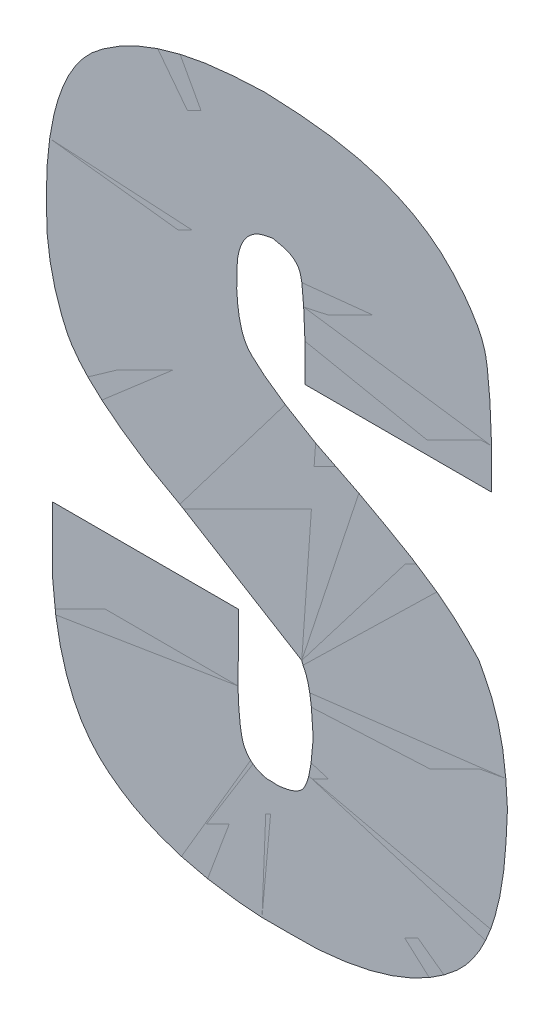
ISO-10303-21;
HEADER;
FILE_DESCRIPTION(('STEP AP214'),'2;1');
FILE_NAME('part.step','',(''),(''),'','','');
FILE_SCHEMA(('AUTOMOTIVE_DESIGN { 1 0 10303 214 1 1 1 1 }'));
ENDSEC;
DATA;
#1=APPLICATION_CONTEXT('core data for automotive mechanical design processes');
#2=APPLICATION_PROTOCOL_DEFINITION('international standard','automotive_design',2000,#1);
#3=PRODUCT_CONTEXT('',#1,'mechanical');
#4=PRODUCT('Part','Part','',(#3));
#5=PRODUCT_RELATED_PRODUCT_CATEGORY('part','',(#4));
#6=PRODUCT_DEFINITION_FORMATION('','',#4);
#7=PRODUCT_DEFINITION_CONTEXT('part definition',#1,'design');
#8=PRODUCT_DEFINITION('design','',#6,#7);
#9=PRODUCT_DEFINITION_SHAPE('','',#8);
#10=(LENGTH_UNIT() NAMED_UNIT(*) SI_UNIT(.MILLI.,.METRE.));
#11=(NAMED_UNIT(*) PLANE_ANGLE_UNIT() SI_UNIT($,.RADIAN.));
#12=(NAMED_UNIT(*) SI_UNIT($,.STERADIAN.) SOLID_ANGLE_UNIT());
#13=UNCERTAINTY_MEASURE_WITH_UNIT(LENGTH_MEASURE(1.E-05),#10,'distance_accuracy_value','');
#14=(GEOMETRIC_REPRESENTATION_CONTEXT(3) GLOBAL_UNCERTAINTY_ASSIGNED_CONTEXT((#13)) GLOBAL_UNIT_ASSIGNED_CONTEXT((#10,
#11,#12)) REPRESENTATION_CONTEXT('',''));
#15=CARTESIAN_POINT('',(0.,0.,0.));
#16=DIRECTION('',(0.,0.,1.));
#17=DIRECTION('',(1.,0.,0.));
#18=AXIS2_PLACEMENT_3D('',#15,#16,#17);
#19=CARTESIAN_POINT('',(6.842343384447,0.781799056295,0.001668));
#20=DIRECTION('',(0.,0.,1.));
#21=DIRECTION('',(1.,0.,0.));
#22=AXIS2_PLACEMENT_3D('',#19,#20,#21);
#23=PLANE('',#22);
#24=CARTESIAN_POINT('',(6.841944020248,0.844309953316,0.001668));
#25=CARTESIAN_POINT('',(6.84735743524991,0.844054387373995,0.001668));
#26=CARTESIAN_POINT('',(6.8491180972205,0.840933917094,0.001668));
#27=CARTESIAN_POINT('',(6.850552912615,0.838390953782129,0.001668));
#28=CARTESIAN_POINT('',(6.850552912615,0.824897745039,0.001668));
#29=B_SPLINE_CURVE_WITH_KNOTS('',2,(#24,#25,#26,#27,#28),.UNSPECIFIED.,.F.,.F.,(3,2,3),(0.,0.5,
1.),.UNSPECIFIED.);
#30=CARTESIAN_POINT('',(6.841944020248,0.844309953316,0.0015));
#31=VERTEX_POINT('',#30);
#32=CARTESIAN_POINT('',(6.850552912615,0.824897745039,0.0015));
#33=VERTEX_POINT('',#32);
#34=EDGE_CURVE('E363',#31,#33,#29,.T.);
#35=ORIENTED_EDGE('',*,*,#34,.T.);
#36=CARTESIAN_POINT('',(6.850552912615,0.824897745039,0.001668));
#37=DIRECTION('',(0.,-1.,0.));
#38=VECTOR('',#37,1.);
#39=LINE('',#36,#38);
#40=CARTESIAN_POINT('',(6.850552912615,0.814938438183,0.0015));
#41=VERTEX_POINT('',#40);
#42=EDGE_CURVE('E28',#33,#41,#39,.T.);
#43=ORIENTED_EDGE('',*,*,#42,.T.);
#44=CARTESIAN_POINT('',(6.850552912615,0.814938438183,0.001668));
#45=DIRECTION('',(1.,0.,0.));
#46=VECTOR('',#45,1.);
#47=LINE('',#44,#46);
#48=CARTESIAN_POINT('',(6.90018064508,0.814938438183,0.0015));
#49=VERTEX_POINT('',#48);
#50=EDGE_CURVE('E11',#41,#49,#47,.T.);
#51=ORIENTED_EDGE('',*,*,#50,.T.);
#52=CARTESIAN_POINT('',(6.90018064508,0.814938438183,0.001668));
#53=DIRECTION('',(0.,1.,0.));
#54=VECTOR('',#53,1.);
#55=LINE('',#52,#54);
#56=CARTESIAN_POINT('',(6.90018064508,0.825572952283,0.0015));
#57=VERTEX_POINT('',#56);
#58=EDGE_CURVE('E92',#49,#57,#55,.T.);
#59=ORIENTED_EDGE('',*,*,#58,.T.);
#60=CARTESIAN_POINT('',(6.90018064508,0.825572952283,0.001668));
#61=CARTESIAN_POINT('',(6.90018064508,0.838816903601868,0.001668));
#62=CARTESIAN_POINT('',(6.8987458296855,0.8459135705215,0.001668));
#63=CARTESIAN_POINT('',(6.89750927055009,0.85202965231435,0.001668));
#64=CARTESIAN_POINT('',(6.890474540941,0.860008521749,0.001668));
#65=CARTESIAN_POINT('',(6.87559179209619,0.876888702859,0.001668));
#66=CARTESIAN_POINT('',(6.839749596704,0.876888702859,0.001668));
#67=B_SPLINE_CURVE_WITH_KNOTS('',2,(#60,#61,#62,#63,#64,#65,#66),.UNSPECIFIED.,.F.,.F.,(3,2,2,
3),(0.,0.25,0.5,1.),.UNSPECIFIED.);
#68=CARTESIAN_POINT('',(6.839749596704,0.876888702859,0.0015));
#69=VERTEX_POINT('',#68);
#70=EDGE_CURVE('E89',#57,#69,#67,.T.);
#71=ORIENTED_EDGE('',*,*,#70,.T.);
#72=CARTESIAN_POINT('',(6.839749596704,0.876888702859,0.001668));
#73=CARTESIAN_POINT('',(6.8113718671602,0.876888702859,0.001668));
#74=CARTESIAN_POINT('',(6.79552352219413,0.864376268610875,0.001668));
#75=CARTESIAN_POINT('',(6.781850575494,0.853581334065366,0.001668));
#76=CARTESIAN_POINT('',(6.781850575494,0.822534519683,0.001668));
#77=B_SPLINE_CURVE_WITH_KNOTS('',2,(#72,#73,#74,#75,#76),.UNSPECIFIED.,.F.,.F.,(3,2,3),(0.,0.5,
1.),.UNSPECIFIED.);
#78=CARTESIAN_POINT('',(6.781850575494,0.822534519683,0.0015));
#79=VERTEX_POINT('',#78);
#80=EDGE_CURVE('E239',#69,#79,#77,.T.);
#81=ORIENTED_EDGE('',*,*,#80,.T.);
#82=CARTESIAN_POINT('',(6.781850575494,0.822534519683,0.001668));
#83=CARTESIAN_POINT('',(6.781850575494,0.807498247992182,0.001668));
#84=CARTESIAN_POINT('',(6.7872522334495,0.7958638335285,0.001668));
#85=CARTESIAN_POINT('',(6.79244996611719,0.784668645564816,0.001668));
#86=CARTESIAN_POINT('',(6.817298955827,0.770712363674,0.001668));
#87=B_SPLINE_CURVE_WITH_KNOTS('',2,(#82,#83,#84,#85,#86),.UNSPECIFIED.,.F.,.F.,(3,2,3),(0.,0.5,
1.),.UNSPECIFIED.);
#88=CARTESIAN_POINT('',(6.817298955827,0.770712363674,0.0015));
#89=VERTEX_POINT('',#88);
#90=EDGE_CURVE('E236',#79,#89,#87,.T.);
#91=ORIENTED_EDGE('',*,*,#90,.T.);
#92=CARTESIAN_POINT('',(6.817298955827,0.770712363674,0.001668));
#93=DIRECTION('',(0.853940796175856,-0.520370172691081,0.));
#94=VECTOR('',#93,1.);
#95=LINE('',#92,#94);
#96=CARTESIAN_POINT('',(6.849708903559,0.750962551774,0.0015));
#97=VERTEX_POINT('',#96);
#98=EDGE_CURVE('E224',#89,#97,#95,.T.);
#99=ORIENTED_EDGE('',*,*,#98,.T.);
#100=CARTESIAN_POINT('',(6.849708903559,0.750962551774,0.001668));
#101=CARTESIAN_POINT('',(6.852747336159,0.746872302777746,0.001668));
#102=CARTESIAN_POINT('',(6.852747336159,0.734588776097,0.001668));
#103=B_SPLINE_CURVE_WITH_KNOTS('',2,(#100,#101,#102),.UNSPECIFIED.,.F.,.F.,(3,3),(0.,1.),.UNSPECIFIED.);
#104=CARTESIAN_POINT('',(6.852747336159,0.734588776097,0.0015));
#105=VERTEX_POINT('',#104);
#106=EDGE_CURVE('E233',#97,#105,#103,.T.);
#107=ORIENTED_EDGE('',*,*,#106,.T.);
#108=CARTESIAN_POINT('',(6.852747336159,0.734588776097,0.001668));
#109=CARTESIAN_POINT('',(6.85256843999959,0.725471815599463,0.001668));
#110=CARTESIAN_POINT('',(6.8503841108035,0.7220130411695,0.001668));
#111=CARTESIAN_POINT('',(6.84868306782237,0.719319525934746,0.001668));
#112=CARTESIAN_POINT('',(6.842112822059,0.719059009475,0.001668));
#113=B_SPLINE_CURVE_WITH_KNOTS('',2,(#108,#109,#110,#111,#112),.UNSPECIFIED.,.F.,.F.,(3,2,3),
(0.,0.5,1.),.UNSPECIFIED.);
#114=CARTESIAN_POINT('',(6.842112822059,0.719059009475,0.0015));
#115=VERTEX_POINT('',#114);
#116=EDGE_CURVE('E238',#105,#115,#113,.T.);
#117=ORIENTED_EDGE('',*,*,#116,.T.);
#118=CARTESIAN_POINT('',(6.842112822059,0.719059009475,0.001668));
#119=CARTESIAN_POINT('',(6.83682348482915,0.719391245199637,0.001668));
#120=CARTESIAN_POINT('',(6.8346855423705,0.723447856564,0.001668));
#121=CARTESIAN_POINT('',(6.832828722448,0.726971055595247,0.001668));
#122=CARTESIAN_POINT('',(6.832828722448,0.74269126303,0.001668));
#123=B_SPLINE_CURVE_WITH_KNOTS('',2,(#118,#119,#120,#121,#122),.UNSPECIFIED.,.F.,.F.,(3,2,3),
(0.,0.5,1.),.UNSPECIFIED.);
#124=CARTESIAN_POINT('',(6.832828722448,0.74269126303,0.0015));
#125=VERTEX_POINT('',#124);
#126=EDGE_CURVE('E286',#115,#125,#123,.T.);
#127=ORIENTED_EDGE('',*,*,#126,.T.);
#128=CARTESIAN_POINT('',(6.832828722448,0.74269126303,0.001668));
#129=DIRECTION('',(0.,1.,0.));
#130=VECTOR('',#129,1.);
#131=LINE('',#128,#130);
#132=CARTESIAN_POINT('',(6.832828722448,0.754338587996,0.0015));
#133=VERTEX_POINT('',#132);
#134=EDGE_CURVE('E374',#125,#133,#131,.T.);
#135=ORIENTED_EDGE('',*,*,#134,.T.);
#136=CARTESIAN_POINT('',(6.832828722448,0.754338587996,0.001668));
#137=DIRECTION('',(-1.,0.,0.));
#138=VECTOR('',#137,1.);
#139=LINE('',#136,#138);
#140=CARTESIAN_POINT('',(6.783369791794,0.754338587996,0.0015));
#141=VERTEX_POINT('',#140);
#142=EDGE_CURVE('E372',#133,#141,#139,.T.);
#143=ORIENTED_EDGE('',*,*,#142,.T.);
#144=CARTESIAN_POINT('',(6.783369791794,0.754338587996,0.001668));
#145=DIRECTION('',(0.,-1.,0.));
#146=VECTOR('',#145,1.);
#147=LINE('',#144,#146);
#148=CARTESIAN_POINT('',(6.783369791794,0.745560893819,0.0015));
#149=VERTEX_POINT('',#148);
#150=EDGE_CURVE('E371',#141,#149,#147,.T.);
#151=ORIENTED_EDGE('',*,*,#150,.T.);
#152=CARTESIAN_POINT('',(6.783369791794,0.745560893819,0.001668));
#153=CARTESIAN_POINT('',(6.783369791794,0.713191998116072,0.001668));
#154=CARTESIAN_POINT('',(6.79706383872,0.700976115460375,0.001668));
#155=CARTESIAN_POINT('',(6.81331374316268,0.686480259932,0.001668));
#156=CARTESIAN_POINT('',(6.846332867337,0.686480259932,0.001668));
#157=B_SPLINE_CURVE_WITH_KNOTS('',2,(#152,#153,#154,#155,#156),.UNSPECIFIED.,.F.,.F.,(3,2,3),
(0.,0.5,1.),.UNSPECIFIED.);
#158=CARTESIAN_POINT('',(6.846332867337,0.686480259932,0.0015));
#159=VERTEX_POINT('',#158);
#160=EDGE_CURVE('E299',#149,#159,#157,.T.);
#161=ORIENTED_EDGE('',*,*,#160,.T.);
#162=CARTESIAN_POINT('',(6.846332867337,0.686480259932,0.001668));
#163=CARTESIAN_POINT('',(6.87523705434836,0.686480259932,0.001668));
#164=CARTESIAN_POINT('',(6.89081214456325,0.70011100617825,0.001668));
#165=CARTESIAN_POINT('',(6.904400690357,0.712003201794113,0.001668));
#166=CARTESIAN_POINT('',(6.904400690357,0.744041677519,0.001668));
#167=B_SPLINE_CURVE_WITH_KNOTS('',2,(#162,#163,#164,#165,#166),.UNSPECIFIED.,.F.,.F.,(3,2,3),
(0.,0.5,1.),.UNSPECIFIED.);
#168=CARTESIAN_POINT('',(6.904400690357,0.744041677519,0.0015));
#169=VERTEX_POINT('',#168);
#170=EDGE_CURVE('E310',#159,#169,#167,.T.);
#171=ORIENTED_EDGE('',*,*,#170,.T.);
#172=CARTESIAN_POINT('',(6.904400690357,0.744041677519,0.001668));
#173=CARTESIAN_POINT('',(6.904400690357,0.763338874595314,0.001668));
#174=CARTESIAN_POINT('',(6.896804608858,0.774594805329,0.001668));
#175=B_SPLINE_CURVE_WITH_KNOTS('',2,(#172,#173,#174),.UNSPECIFIED.,.F.,.F.,(3,3),(0.,1.),.UNSPECIFIED.);
#176=CARTESIAN_POINT('',(6.896804608858,0.774594805329,0.0015));
#177=VERTEX_POINT('',#176);
#178=EDGE_CURVE('E321',#169,#177,#175,.T.);
#179=ORIENTED_EDGE('',*,*,#178,.T.);
#180=CARTESIAN_POINT('',(6.896804608858,0.774594805329,0.001668));
#181=CARTESIAN_POINT('',(6.88825229663385,0.785694153808786,0.001668));
#182=CARTESIAN_POINT('',(6.864901066559,0.797045446206,0.001668));
#183=B_SPLINE_CURVE_WITH_KNOTS('',2,(#180,#181,#182),.UNSPECIFIED.,.F.,.F.,(3,3),(0.,1.),.UNSPECIFIED.);
#184=CARTESIAN_POINT('',(6.864901066559,0.797045446206,0.0015));
#185=VERTEX_POINT('',#184);
#186=EDGE_CURVE('E332',#177,#185,#183,.T.);
#187=ORIENTED_EDGE('',*,*,#186,.T.);
#188=CARTESIAN_POINT('',(6.864901066559,0.797045446206,0.001668));
#189=CARTESIAN_POINT('',(6.84265966103299,0.808166148969004,0.001668));
#190=CARTESIAN_POINT('',(6.83603595685963,0.815276041805875,0.001668));
#191=CARTESIAN_POINT('',(6.832491118826,0.819081075648492,0.001668));
#192=CARTESIAN_POINT('',(6.832491118826,0.831818619294,0.001668));
#193=B_SPLINE_CURVE_WITH_KNOTS('',2,(#188,#189,#190,#191,#192),.UNSPECIFIED.,.F.,.F.,(3,2,3),
(0.,0.5,1.),.UNSPECIFIED.);
#194=CARTESIAN_POINT('',(6.832491118826,0.831818619294,0.0015));
#195=VERTEX_POINT('',#194);
#196=EDGE_CURVE('E343',#185,#195,#193,.T.);
#197=ORIENTED_EDGE('',*,*,#196,.T.);
#198=CARTESIAN_POINT('',(6.832491118826,0.831818619294,0.001668));
#199=CARTESIAN_POINT('',(6.83284891114482,0.843837156323268,0.001668));
#200=CARTESIAN_POINT('',(6.841944020248,0.844309953316,0.001668));
#201=B_SPLINE_CURVE_WITH_KNOTS('',2,(#198,#199,#200),.UNSPECIFIED.,.F.,.F.,(3,3),(0.,1.),.UNSPECIFIED.);
#202=EDGE_CURVE('E353',#195,#31,#201,.T.);
#203=ORIENTED_EDGE('',*,*,#202,.T.);
#204=EDGE_LOOP('',(#35,#43,#51,#59,#71,#81,#91,#99,#107,#117,#127,#135,#143,#151,#161,#171,#179,
#187,#197,#203));
#205=FACE_BOUND('',#204,.T.);
#206=ADVANCED_FACE('F17',(#205),#23,.T.);
#207=CARTESIAN_POINT('',(6.842343384447,0.781799056295,0.001332));
#208=DIRECTION('',(0.,0.,1.));
#209=DIRECTION('',(1.,0.,0.));
#210=AXIS2_PLACEMENT_3D('',#207,#208,#209);
#211=PLANE('',#210);
#212=ORIENTED_EDGE('',*,*,#42,.F.);
#213=ORIENTED_EDGE('',*,*,#34,.F.);
#214=ORIENTED_EDGE('',*,*,#202,.F.);
#215=ORIENTED_EDGE('',*,*,#196,.F.);
#216=ORIENTED_EDGE('',*,*,#186,.F.);
#217=ORIENTED_EDGE('',*,*,#178,.F.);
#218=ORIENTED_EDGE('',*,*,#170,.F.);
#219=ORIENTED_EDGE('',*,*,#160,.F.);
#220=ORIENTED_EDGE('',*,*,#150,.F.);
#221=ORIENTED_EDGE('',*,*,#142,.F.);
#222=ORIENTED_EDGE('',*,*,#134,.F.);
#223=ORIENTED_EDGE('',*,*,#126,.F.);
#224=ORIENTED_EDGE('',*,*,#116,.F.);
#225=ORIENTED_EDGE('',*,*,#106,.F.);
#226=ORIENTED_EDGE('',*,*,#98,.F.);
#227=ORIENTED_EDGE('',*,*,#90,.F.);
#228=ORIENTED_EDGE('',*,*,#80,.F.);
#229=ORIENTED_EDGE('',*,*,#70,.F.);
#230=ORIENTED_EDGE('',*,*,#58,.F.);
#231=ORIENTED_EDGE('',*,*,#50,.F.);
#232=EDGE_LOOP('',(#212,#213,#214,#215,#216,#217,#218,#219,#220,#221,#222,#223,#224,#225,#226,
#227,#228,#229,#230,#231));
#233=FACE_BOUND('',#232,.T.);
#234=ADVANCED_FACE('F94',(#233),#211,.F.);
#235=CLOSED_SHELL('',(#206,#234));
#236=MANIFOLD_SOLID_BREP('B1',#235);
#237=ADVANCED_BREP_SHAPE_REPRESENTATION('',(#18,#236),#14);
#238=SHAPE_DEFINITION_REPRESENTATION(#9,#237);
ENDSEC;
END-ISO-10303-21;
